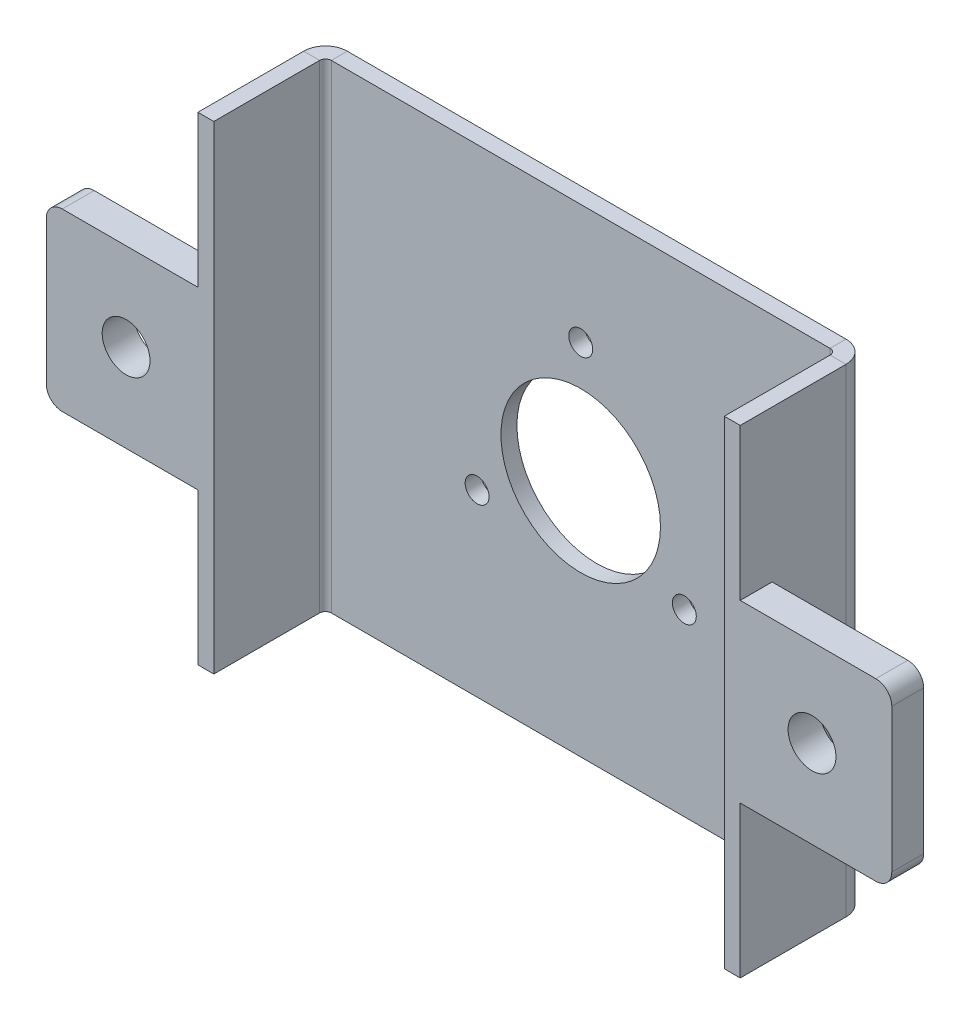
ISO-10303-21;
HEADER;
FILE_DESCRIPTION(('STEP AP214'),'2;1');
FILE_NAME('part.step','',(''),(''),'','','');
FILE_SCHEMA(('AUTOMOTIVE_DESIGN { 1 0 10303 214 1 1 1 1 }'));
ENDSEC;
DATA;
#1=APPLICATION_CONTEXT('core data for automotive mechanical design processes');
#2=APPLICATION_PROTOCOL_DEFINITION('international standard','automotive_design',2000,#1);
#3=PRODUCT_CONTEXT('',#1,'mechanical');
#4=PRODUCT('Part','Part','',(#3));
#5=PRODUCT_RELATED_PRODUCT_CATEGORY('part','',(#4));
#6=PRODUCT_DEFINITION_FORMATION('','',#4);
#7=PRODUCT_DEFINITION_CONTEXT('part definition',#1,'design');
#8=PRODUCT_DEFINITION('design','',#6,#7);
#9=PRODUCT_DEFINITION_SHAPE('','',#8);
#10=(LENGTH_UNIT() NAMED_UNIT(*) SI_UNIT(.MILLI.,.METRE.));
#11=(NAMED_UNIT(*) PLANE_ANGLE_UNIT() SI_UNIT($,.RADIAN.));
#12=(NAMED_UNIT(*) SI_UNIT($,.STERADIAN.) SOLID_ANGLE_UNIT());
#13=UNCERTAINTY_MEASURE_WITH_UNIT(LENGTH_MEASURE(1.E-05),#10,'distance_accuracy_value','');
#14=(GEOMETRIC_REPRESENTATION_CONTEXT(3) GLOBAL_UNCERTAINTY_ASSIGNED_CONTEXT((#13)) GLOBAL_UNIT_ASSIGNED_CONTEXT((#10,
#11,#12)) REPRESENTATION_CONTEXT('',''));
#15=CARTESIAN_POINT('',(0.,0.,0.));
#16=DIRECTION('',(0.,0.,1.));
#17=DIRECTION('',(1.,0.,0.));
#18=AXIS2_PLACEMENT_3D('',#15,#16,#17);
#19=CARTESIAN_POINT('',(0.,0.,0.));
#20=DIRECTION('',(0.,0.,-1.));
#21=DIRECTION('',(-1.,0.,0.));
#22=AXIS2_PLACEMENT_3D('',#19,#20,#21);
#23=PLANE('',#22);
#24=CARTESIAN_POINT('',(12.9903810567666,-7.49999999999988,0.));
#25=DIRECTION('',(0.,0.,1.));
#26=DIRECTION('',(1.,0.,0.));
#27=AXIS2_PLACEMENT_3D('',#24,#25,#26);
#28=CIRCLE('',#27,1.5);
#29=CARTESIAN_POINT('',(14.4903810567666,-7.49999999999988,0.));
#30=VERTEX_POINT('',#29);
#31=EDGE_CURVE('E445',#30,#30,#28,.T.);
#32=ORIENTED_EDGE('',*,*,#31,.F.);
#33=EDGE_LOOP('',(#32));
#34=FACE_BOUND('',#33,.T.);
#35=DIRECTION('',(0.,1.,0.));
#36=VECTOR('',#35,1.);
#37=CARTESIAN_POINT('',(31.2634,30.,0.));
#38=LINE('',#37,#36);
#39=CARTESIAN_POINT('',(31.2634,30.,0.));
#40=VERTEX_POINT('',#39);
#41=CARTESIAN_POINT('',(31.2634,-30.,0.));
#42=VERTEX_POINT('',#41);
#43=EDGE_CURVE('E307',#40,#42,#38,.F.);
#44=ORIENTED_EDGE('',*,*,#43,.F.);
#45=DIRECTION('',(-1.,0.,0.));
#46=VECTOR('',#45,1.);
#47=CARTESIAN_POINT('',(-32.,30.,0.));
#48=LINE('',#47,#46);
#49=CARTESIAN_POINT('',(-31.2634,30.,0.));
#50=VERTEX_POINT('',#49);
#51=EDGE_CURVE('E369',#40,#50,#48,.T.);
#52=ORIENTED_EDGE('',*,*,#51,.T.);
#53=DIRECTION('',(0.,-1.,0.));
#54=VECTOR('',#53,1.);
#55=CARTESIAN_POINT('',(-31.2634,-30.,0.));
#56=LINE('',#55,#54);
#57=CARTESIAN_POINT('',(-31.2634,-30.,0.));
#58=VERTEX_POINT('',#57);
#59=EDGE_CURVE('E362',#58,#50,#56,.F.);
#60=ORIENTED_EDGE('',*,*,#59,.F.);
#61=DIRECTION('',(1.,0.,0.));
#62=VECTOR('',#61,1.);
#63=CARTESIAN_POINT('',(-32.,-30.,0.));
#64=LINE('',#63,#62);
#65=EDGE_CURVE('E376',#58,#42,#64,.T.);
#66=ORIENTED_EDGE('',*,*,#65,.T.);
#67=EDGE_LOOP('',(#44,#52,#60,#66));
#68=FACE_BOUND('',#67,.T.);
#69=CARTESIAN_POINT('',(0.,0.,0.));
#70=DIRECTION('',(0.,0.,1.));
#71=DIRECTION('',(1.,0.,0.));
#72=AXIS2_PLACEMENT_3D('',#69,#70,#71);
#73=CIRCLE('',#72,10.);
#74=CARTESIAN_POINT('',(10.,0.,0.));
#75=VERTEX_POINT('',#74);
#76=EDGE_CURVE('E427',#75,#75,#73,.T.);
#77=ORIENTED_EDGE('',*,*,#76,.F.);
#78=EDGE_LOOP('',(#77));
#79=FACE_BOUND('',#78,.T.);
#80=CARTESIAN_POINT('',(0.,15.,0.));
#81=DIRECTION('',(0.,0.,1.));
#82=DIRECTION('',(1.,0.,0.));
#83=AXIS2_PLACEMENT_3D('',#80,#81,#82);
#84=CIRCLE('',#83,1.5);
#85=CARTESIAN_POINT('',(1.5,15.,0.));
#86=VERTEX_POINT('',#85);
#87=EDGE_CURVE('E436',#86,#86,#84,.T.);
#88=ORIENTED_EDGE('',*,*,#87,.F.);
#89=EDGE_LOOP('',(#88));
#90=FACE_BOUND('',#89,.T.);
#91=CARTESIAN_POINT('',(-12.9903810567665,-7.50000000000006,0.));
#92=DIRECTION('',(0.,0.,1.));
#93=DIRECTION('',(1.,0.,0.));
#94=AXIS2_PLACEMENT_3D('',#91,#92,#93);
#95=CIRCLE('',#94,1.5);
#96=CARTESIAN_POINT('',(-11.4903810567665,-7.50000000000006,0.));
#97=VERTEX_POINT('',#96);
#98=EDGE_CURVE('E442',#97,#97,#95,.T.);
#99=ORIENTED_EDGE('',*,*,#98,.F.);
#100=EDGE_LOOP('',(#99));
#101=FACE_BOUND('',#100,.T.);
#102=ADVANCED_FACE('F35',(#34,#68,#79,#90,#101),#23,.F.);
#103=CARTESIAN_POINT('',(-34.,0.,-1.18005265140202E-13));
#104=DIRECTION('',(1.,0.,0.));
#105=DIRECTION('',(0.,0.,-1.));
#106=AXIS2_PLACEMENT_3D('',#103,#104,#105);
#107=PLANE('',#106);
#108=DIRECTION('',(0.,0.,-1.));
#109=VECTOR('',#108,1.);
#110=CARTESIAN_POINT('',(-34.,11.,9.99999999999999));
#111=LINE('',#110,#109);
#112=CARTESIAN_POINT('',(-34.0000000000001,11.,14.));
#113=VERTEX_POINT('',#112);
#114=CARTESIAN_POINT('',(-34.,11.,10.));
#115=VERTEX_POINT('',#114);
#116=EDGE_CURVE('E209',#113,#115,#111,.T.);
#117=ORIENTED_EDGE('',*,*,#116,.F.);
#118=DIRECTION('',(0.,1.,0.));
#119=VECTOR('',#118,1.);
#120=CARTESIAN_POINT('',(-34.0000000000001,30.,14.));
#121=LINE('',#120,#119);
#122=CARTESIAN_POINT('',(-34.0000000000001,30.,14.));
#123=VERTEX_POINT('',#122);
#124=EDGE_CURVE('E329',#113,#123,#121,.T.);
#125=ORIENTED_EDGE('',*,*,#124,.T.);
#126=DIRECTION('',(0.,0.,-1.));
#127=VECTOR('',#126,1.);
#128=CARTESIAN_POINT('',(-34.,30.,0.));
#129=LINE('',#128,#127);
#130=CARTESIAN_POINT('',(-34.,30.,0.73659999999999));
#131=VERTEX_POINT('',#130);
#132=EDGE_CURVE('E334',#123,#131,#129,.T.);
#133=ORIENTED_EDGE('',*,*,#132,.T.);
#134=DIRECTION('',(0.,1.,0.));
#135=VECTOR('',#134,1.);
#136=CARTESIAN_POINT('',(-34.,0.,0.73659999999999));
#137=LINE('',#136,#135);
#138=CARTESIAN_POINT('',(-34.,-30.,0.73659999999999));
#139=VERTEX_POINT('',#138);
#140=EDGE_CURVE('E322',#139,#131,#137,.T.);
#141=ORIENTED_EDGE('',*,*,#140,.F.);
#142=DIRECTION('',(0.,0.,1.));
#143=VECTOR('',#142,1.);
#144=CARTESIAN_POINT('',(-34.0000000000001,-30.,14.));
#145=LINE('',#144,#143);
#146=CARTESIAN_POINT('',(-34.0000000000001,-30.,14.));
#147=VERTEX_POINT('',#146);
#148=EDGE_CURVE('E327',#139,#147,#145,.T.);
#149=ORIENTED_EDGE('',*,*,#148,.T.);
#150=CARTESIAN_POINT('',(-34.0000000000001,-11.,14.));
#151=VERTEX_POINT('',#150);
#152=EDGE_CURVE('E331',#147,#151,#121,.T.);
#153=ORIENTED_EDGE('',*,*,#152,.T.);
#154=DIRECTION('',(0.,0.,1.));
#155=VECTOR('',#154,1.);
#156=CARTESIAN_POINT('',(-34.,-11.,10.));
#157=LINE('',#156,#155);
#158=CARTESIAN_POINT('',(-34.,-11.,9.99999999999993));
#159=VERTEX_POINT('',#158);
#160=EDGE_CURVE('E250',#159,#151,#157,.T.);
#161=ORIENTED_EDGE('',*,*,#160,.F.);
#162=DIRECTION('',(0.,-1.,0.));
#163=VECTOR('',#162,1.);
#164=CARTESIAN_POINT('',(-34.,11.,9.99999999999999));
#165=LINE('',#164,#163);
#166=EDGE_CURVE('E256',#115,#159,#165,.T.);
#167=ORIENTED_EDGE('',*,*,#166,.F.);
#168=EDGE_LOOP('',(#117,#125,#133,#141,#149,#153,#161,#167));
#169=FACE_BOUND('',#168,.T.);
#170=ADVANCED_FACE('F458',(#169),#107,.F.);
#171=CARTESIAN_POINT('',(0.,0.,-2.));
#172=DIRECTION('',(0.,0.,-1.));
#173=DIRECTION('',(-1.,0.,0.));
#174=AXIS2_PLACEMENT_3D('',#171,#172,#173);
#175=PLANE('',#174);
#176=CARTESIAN_POINT('',(12.9903810567666,-7.49999999999988,-2.));
#177=DIRECTION('',(0.,0.,-1.));
#178=DIRECTION('',(-1.,0.,0.));
#179=AXIS2_PLACEMENT_3D('',#176,#177,#178);
#180=CIRCLE('',#179,1.5);
#181=CARTESIAN_POINT('',(11.4903810567667,-7.49999999999988,-2.));
#182=VERTEX_POINT('',#181);
#183=EDGE_CURVE('E39',#182,#182,#180,.T.);
#184=ORIENTED_EDGE('',*,*,#183,.F.);
#185=EDGE_LOOP('',(#184));
#186=FACE_BOUND('',#185,.T.);
#187=CARTESIAN_POINT('',(-12.9903810567665,-7.50000000000006,-2.));
#188=DIRECTION('',(0.,0.,-1.));
#189=DIRECTION('',(-1.,0.,0.));
#190=AXIS2_PLACEMENT_3D('',#187,#188,#189);
#191=CIRCLE('',#190,1.5);
#192=CARTESIAN_POINT('',(-14.4903810567665,-7.50000000000006,-2.));
#193=VERTEX_POINT('',#192);
#194=EDGE_CURVE('E439',#193,#193,#191,.T.);
#195=ORIENTED_EDGE('',*,*,#194,.F.);
#196=EDGE_LOOP('',(#195));
#197=FACE_BOUND('',#196,.T.);
#198=CARTESIAN_POINT('',(0.,15.,-2.));
#199=DIRECTION('',(0.,0.,-1.));
#200=DIRECTION('',(-1.,0.,0.));
#201=AXIS2_PLACEMENT_3D('',#198,#199,#200);
#202=CIRCLE('',#201,1.5);
#203=CARTESIAN_POINT('',(-1.5,15.,-2.));
#204=VERTEX_POINT('',#203);
#205=EDGE_CURVE('E431',#204,#204,#202,.T.);
#206=ORIENTED_EDGE('',*,*,#205,.F.);
#207=EDGE_LOOP('',(#206));
#208=FACE_BOUND('',#207,.T.);
#209=CARTESIAN_POINT('',(0.,0.,-2.));
#210=DIRECTION('',(0.,0.,-1.));
#211=DIRECTION('',(-1.,0.,0.));
#212=AXIS2_PLACEMENT_3D('',#209,#210,#211);
#213=CIRCLE('',#212,10.);
#214=CARTESIAN_POINT('',(-10.,0.,-2.));
#215=VERTEX_POINT('',#214);
#216=EDGE_CURVE('E428',#215,#215,#213,.F.);
#217=ORIENTED_EDGE('',*,*,#216,.T.);
#218=EDGE_LOOP('',(#217));
#219=FACE_BOUND('',#218,.T.);
#220=DIRECTION('',(-1.,0.,0.));
#221=VECTOR('',#220,1.);
#222=CARTESIAN_POINT('',(-32.,30.,-2.));
#223=LINE('',#222,#221);
#224=CARTESIAN_POINT('',(31.2634,30.,-2.));
#225=VERTEX_POINT('',#224);
#226=CARTESIAN_POINT('',(-31.2634,30.,-2.));
#227=VERTEX_POINT('',#226);
#228=EDGE_CURVE('E372',#225,#227,#223,.T.);
#229=ORIENTED_EDGE('',*,*,#228,.F.);
#230=DIRECTION('',(0.,1.,0.));
#231=VECTOR('',#230,1.);
#232=CARTESIAN_POINT('',(31.2634,30.,-2.));
#233=LINE('',#232,#231);
#234=CARTESIAN_POINT('',(31.2634,-30.,-2.));
#235=VERTEX_POINT('',#234);
#236=EDGE_CURVE('E294',#225,#235,#233,.F.);
#237=ORIENTED_EDGE('',*,*,#236,.T.);
#238=DIRECTION('',(1.,0.,0.));
#239=VECTOR('',#238,1.);
#240=CARTESIAN_POINT('',(-32.,-30.,-2.));
#241=LINE('',#240,#239);
#242=CARTESIAN_POINT('',(-31.2634,-30.,-2.));
#243=VERTEX_POINT('',#242);
#244=EDGE_CURVE('E375',#243,#235,#241,.T.);
#245=ORIENTED_EDGE('',*,*,#244,.F.);
#246=DIRECTION('',(0.,-1.,0.));
#247=VECTOR('',#246,1.);
#248=CARTESIAN_POINT('',(-31.2634,-30.,-2.));
#249=LINE('',#248,#247);
#250=EDGE_CURVE('E349',#243,#227,#249,.F.);
#251=ORIENTED_EDGE('',*,*,#250,.T.);
#252=EDGE_LOOP('',(#229,#237,#245,#251));
#253=FACE_BOUND('',#252,.T.);
#254=ADVANCED_FACE('F454',(#186,#197,#208,#219,#253),#175,.T.);
#255=CARTESIAN_POINT('',(-32.,30.,-2.));
#256=DIRECTION('',(0.,1.,0.));
#257=DIRECTION('',(0.,0.,1.));
#258=AXIS2_PLACEMENT_3D('',#255,#256,#257);
#259=PLANE('',#258);
#260=ORIENTED_EDGE('',*,*,#51,.F.);
#261=DIRECTION('',(0.,0.,-1.));
#262=VECTOR('',#261,1.);
#263=CARTESIAN_POINT('',(31.2634,30.,0.));
#264=LINE('',#263,#262);
#265=EDGE_CURVE('E301',#40,#225,#264,.T.);
#266=ORIENTED_EDGE('',*,*,#265,.T.);
#267=ORIENTED_EDGE('',*,*,#228,.T.);
#268=DIRECTION('',(0.,0.,-1.));
#269=VECTOR('',#268,1.);
#270=CARTESIAN_POINT('',(-31.2634,30.,0.));
#271=LINE('',#270,#269);
#272=EDGE_CURVE('E366',#50,#227,#271,.T.);
#273=ORIENTED_EDGE('',*,*,#272,.F.);
#274=EDGE_LOOP('',(#260,#266,#267,#273));
#275=FACE_BOUND('',#274,.T.);
#276=ADVANCED_FACE('F457',(#275),#259,.T.);
#277=CARTESIAN_POINT('',(-32.,-30.,-2.));
#278=DIRECTION('',(0.,-1.,0.));
#279=DIRECTION('',(0.,0.,-1.));
#280=AXIS2_PLACEMENT_3D('',#277,#278,#279);
#281=PLANE('',#280);
#282=DIRECTION('',(0.,0.,-1.));
#283=VECTOR('',#282,1.);
#284=CARTESIAN_POINT('',(31.2634,-30.,0.));
#285=LINE('',#284,#283);
#286=EDGE_CURVE('E311',#42,#235,#285,.T.);
#287=ORIENTED_EDGE('',*,*,#286,.F.);
#288=ORIENTED_EDGE('',*,*,#65,.F.);
#289=DIRECTION('',(0.,0.,-1.));
#290=VECTOR('',#289,1.);
#291=CARTESIAN_POINT('',(-31.2634,-30.,0.));
#292=LINE('',#291,#290);
#293=EDGE_CURVE('E356',#58,#243,#292,.T.);
#294=ORIENTED_EDGE('',*,*,#293,.T.);
#295=ORIENTED_EDGE('',*,*,#244,.T.);
#296=EDGE_LOOP('',(#287,#288,#294,#295));
#297=FACE_BOUND('',#296,.T.);
#298=ADVANCED_FACE('F486',(#297),#281,.T.);
#299=CARTESIAN_POINT('',(-31.2634,30.,0.7366));
#300=DIRECTION('',(0.,1.,0.));
#301=DIRECTION('',(0.,0.,1.));
#302=AXIS2_PLACEMENT_3D('',#299,#300,#301);
#303=PLANE('',#302);
#304=DIRECTION('',(-1.,0.,0.));
#305=VECTOR('',#304,1.);
#306=CARTESIAN_POINT('',(-32.,30.,0.736599999999997));
#307=LINE('',#306,#305);
#308=CARTESIAN_POINT('',(-32.,30.,0.736599999999997));
#309=VERTEX_POINT('',#308);
#310=EDGE_CURVE('E314',#309,#131,#307,.T.);
#311=ORIENTED_EDGE('',*,*,#310,.F.);
#312=CARTESIAN_POINT('',(-31.2634,30.,0.7366));
#313=DIRECTION('',(0.,-1.,0.));
#314=DIRECTION('',(0.,0.,-1.));
#315=AXIS2_PLACEMENT_3D('',#312,#313,#314);
#316=CIRCLE('',#315,0.736599999999997);
#317=EDGE_CURVE('E359',#50,#309,#316,.F.);
#318=ORIENTED_EDGE('',*,*,#317,.F.);
#319=ORIENTED_EDGE('',*,*,#272,.T.);
#320=CARTESIAN_POINT('',(-31.2634,30.,0.7366));
#321=DIRECTION('',(0.,-1.,0.));
#322=DIRECTION('',(0.,0.,-1.));
#323=AXIS2_PLACEMENT_3D('',#320,#321,#322);
#324=CIRCLE('',#323,2.7366);
#325=EDGE_CURVE('E352',#227,#131,#324,.F.);
#326=ORIENTED_EDGE('',*,*,#325,.T.);
#327=EDGE_LOOP('',(#311,#318,#319,#326));
#328=FACE_BOUND('',#327,.T.);
#329=ADVANCED_FACE('F531',(#328),#303,.T.);
#330=CARTESIAN_POINT('',(-31.2634,-30.,0.7366));
#331=DIRECTION('',(0.,1.,0.));
#332=DIRECTION('',(0.,0.,1.));
#333=AXIS2_PLACEMENT_3D('',#330,#331,#332);
#334=PLANE('',#333);
#335=CARTESIAN_POINT('',(-31.2634,-30.,0.7366));
#336=DIRECTION('',(0.,-1.,0.));
#337=DIRECTION('',(0.,0.,-1.));
#338=AXIS2_PLACEMENT_3D('',#335,#336,#337);
#339=CIRCLE('',#338,0.736599999999997);
#340=CARTESIAN_POINT('',(-32.,-30.,0.736599999999997));
#341=VERTEX_POINT('',#340);
#342=EDGE_CURVE('E348',#341,#58,#339,.T.);
#343=ORIENTED_EDGE('',*,*,#342,.F.);
#344=DIRECTION('',(-1.,0.,0.));
#345=VECTOR('',#344,1.);
#346=CARTESIAN_POINT('',(-32.,-30.,0.736599999999997));
#347=LINE('',#346,#345);
#348=EDGE_CURVE('E319',#341,#139,#347,.T.);
#349=ORIENTED_EDGE('',*,*,#348,.T.);
#350=CARTESIAN_POINT('',(-31.2634,-30.,0.7366));
#351=DIRECTION('',(0.,-1.,0.));
#352=DIRECTION('',(0.,0.,-1.));
#353=AXIS2_PLACEMENT_3D('',#350,#351,#352);
#354=CIRCLE('',#353,2.7366);
#355=EDGE_CURVE('E353',#139,#243,#354,.T.);
#356=ORIENTED_EDGE('',*,*,#355,.T.);
#357=ORIENTED_EDGE('',*,*,#293,.F.);
#358=EDGE_LOOP('',(#343,#349,#356,#357));
#359=FACE_BOUND('',#358,.T.);
#360=ADVANCED_FACE('F594',(#359),#334,.F.);
#361=CARTESIAN_POINT('',(-31.2634,-30.,0.7366));
#362=DIRECTION('',(0.,-1.,0.));
#363=DIRECTION('',(-1.,0.,0.));
#364=AXIS2_PLACEMENT_3D('',#361,#362,#363);
#365=CYLINDRICAL_SURFACE('',#364,2.7366);
#366=ORIENTED_EDGE('',*,*,#250,.F.);
#367=ORIENTED_EDGE('',*,*,#355,.F.);
#368=ORIENTED_EDGE('',*,*,#140,.T.);
#369=ORIENTED_EDGE('',*,*,#325,.F.);
#370=EDGE_LOOP('',(#366,#367,#368,#369));
#371=FACE_BOUND('',#370,.T.);
#372=ADVANCED_FACE('F596',(#371),#365,.T.);
#373=CARTESIAN_POINT('',(-31.2634,-30.,0.7366));
#374=DIRECTION('',(0.,-1.,0.));
#375=DIRECTION('',(-1.,0.,0.));
#376=AXIS2_PLACEMENT_3D('',#373,#374,#375);
#377=CYLINDRICAL_SURFACE('',#376,0.736599999999997);
#378=ORIENTED_EDGE('',*,*,#59,.T.);
#379=ORIENTED_EDGE('',*,*,#317,.T.);
#380=DIRECTION('',(0.,-1.,0.));
#381=VECTOR('',#380,1.);
#382=CARTESIAN_POINT('',(-32.,30.,0.736599999999997));
#383=LINE('',#382,#381);
#384=EDGE_CURVE('E317',#309,#341,#383,.T.);
#385=ORIENTED_EDGE('',*,*,#384,.T.);
#386=ORIENTED_EDGE('',*,*,#342,.T.);
#387=EDGE_LOOP('',(#378,#379,#385,#386));
#388=FACE_BOUND('',#387,.T.);
#389=ADVANCED_FACE('F583',(#388),#377,.F.);
#390=CARTESIAN_POINT('',(-34.0000000000001,-30.,14.));
#391=DIRECTION('',(0.,1.,0.));
#392=DIRECTION('',(0.,0.,1.));
#393=AXIS2_PLACEMENT_3D('',#390,#391,#392);
#394=PLANE('',#393);
#395=ORIENTED_EDGE('',*,*,#348,.F.);
#396=DIRECTION('',(0.,0.,1.));
#397=VECTOR('',#396,1.);
#398=CARTESIAN_POINT('',(-32.0000000000001,-30.,14.));
#399=LINE('',#398,#397);
#400=CARTESIAN_POINT('',(-32.0000000000001,-30.,14.));
#401=VERTEX_POINT('',#400);
#402=EDGE_CURVE('E326',#341,#401,#399,.T.);
#403=ORIENTED_EDGE('',*,*,#402,.T.);
#404=DIRECTION('',(1.,0.,0.));
#405=VECTOR('',#404,1.);
#406=CARTESIAN_POINT('',(-34.0000000000001,-30.,14.));
#407=LINE('',#406,#405);
#408=EDGE_CURVE('E345',#147,#401,#407,.T.);
#409=ORIENTED_EDGE('',*,*,#408,.F.);
#410=ORIENTED_EDGE('',*,*,#148,.F.);
#411=EDGE_LOOP('',(#395,#403,#409,#410));
#412=FACE_BOUND('',#411,.T.);
#413=ADVANCED_FACE('F591',(#412),#394,.F.);
#414=CARTESIAN_POINT('',(-34.,30.,0.));
#415=DIRECTION('',(0.,-1.,0.));
#416=DIRECTION('',(0.,0.,-1.));
#417=AXIS2_PLACEMENT_3D('',#414,#415,#416);
#418=PLANE('',#417);
#419=ORIENTED_EDGE('',*,*,#310,.T.);
#420=ORIENTED_EDGE('',*,*,#132,.F.);
#421=DIRECTION('',(1.,0.,0.));
#422=VECTOR('',#421,1.);
#423=CARTESIAN_POINT('',(-34.0000000000001,30.,14.));
#424=LINE('',#423,#422);
#425=CARTESIAN_POINT('',(-32.0000000000001,30.,14.));
#426=VERTEX_POINT('',#425);
#427=EDGE_CURVE('E337',#123,#426,#424,.T.);
#428=ORIENTED_EDGE('',*,*,#427,.T.);
#429=DIRECTION('',(0.,0.,-1.));
#430=VECTOR('',#429,1.);
#431=CARTESIAN_POINT('',(-32.,30.,0.));
#432=LINE('',#431,#430);
#433=EDGE_CURVE('E330',#426,#309,#432,.T.);
#434=ORIENTED_EDGE('',*,*,#433,.T.);
#435=EDGE_LOOP('',(#419,#420,#428,#434));
#436=FACE_BOUND('',#435,.T.);
#437=ADVANCED_FACE('F578',(#436),#418,.F.);
#438=CARTESIAN_POINT('',(-32.,0.,-1.11022302462516E-13));
#439=DIRECTION('',(1.,0.,0.));
#440=DIRECTION('',(0.,0.,-1.));
#441=AXIS2_PLACEMENT_3D('',#438,#439,#440);
#442=PLANE('',#441);
#443=ORIENTED_EDGE('',*,*,#402,.F.);
#444=ORIENTED_EDGE('',*,*,#384,.F.);
#445=ORIENTED_EDGE('',*,*,#433,.F.);
#446=DIRECTION('',(0.,1.,0.));
#447=VECTOR('',#446,1.);
#448=CARTESIAN_POINT('',(-32.0000000000001,30.,14.));
#449=LINE('',#448,#447);
#450=EDGE_CURVE('E339',#401,#426,#449,.T.);
#451=ORIENTED_EDGE('',*,*,#450,.F.);
#452=EDGE_LOOP('',(#443,#444,#445,#451));
#453=FACE_BOUND('',#452,.T.);
#454=ADVANCED_FACE('F587',(#453),#442,.T.);
#455=CARTESIAN_POINT('',(-34.0000000000001,30.,14.));
#456=DIRECTION('',(0.,0.,-1.));
#457=DIRECTION('',(-1.,0.,0.));
#458=AXIS2_PLACEMENT_3D('',#455,#456,#457);
#459=PLANE('',#458);
#460=CARTESIAN_POINT('',(-43.,0.,14.));
#461=DIRECTION('',(0.,0.,-1.));
#462=DIRECTION('',(-1.,0.,0.));
#463=AXIS2_PLACEMENT_3D('',#460,#461,#462);
#464=CIRCLE('',#463,3.);
#465=CARTESIAN_POINT('',(-46.,0.,14.));
#466=VERTEX_POINT('',#465);
#467=EDGE_CURVE('E228',#466,#466,#464,.T.);
#468=ORIENTED_EDGE('',*,*,#467,.T.);
#469=EDGE_LOOP('',(#468));
#470=FACE_BOUND('',#469,.T.);
#471=DIRECTION('',(0.,1.,0.));
#472=VECTOR('',#471,1.);
#473=CARTESIAN_POINT('',(-53.0000000000001,11.,13.9999999999999));
#474=LINE('',#473,#472);
#475=CARTESIAN_POINT('',(-53.0000000000001,-9.,13.9999999999999));
#476=VERTEX_POINT('',#475);
#477=CARTESIAN_POINT('',(-53.0000000000001,9.,13.9999999999999));
#478=VERTEX_POINT('',#477);
#479=EDGE_CURVE('E246',#476,#478,#474,.T.);
#480=ORIENTED_EDGE('',*,*,#479,.F.);
#481=CARTESIAN_POINT('',(-51.0000000000001,-9.,13.9999999999999));
#482=DIRECTION('',(0.,0.,-1.));
#483=DIRECTION('',(-1.,0.,0.));
#484=AXIS2_PLACEMENT_3D('',#481,#482,#483);
#485=CIRCLE('',#484,2.);
#486=CARTESIAN_POINT('',(-51.0000000000001,-11.,13.9999999999999));
#487=VERTEX_POINT('',#486);
#488=EDGE_CURVE('E391',#476,#487,#485,.F.);
#489=ORIENTED_EDGE('',*,*,#488,.T.);
#490=DIRECTION('',(1.,0.,0.));
#491=VECTOR('',#490,1.);
#492=CARTESIAN_POINT('',(-53.0000000000001,-11.,13.9999999999999));
#493=LINE('',#492,#491);
#494=EDGE_CURVE('E253',#487,#151,#493,.T.);
#495=ORIENTED_EDGE('',*,*,#494,.T.);
#496=ORIENTED_EDGE('',*,*,#152,.F.);
#497=ORIENTED_EDGE('',*,*,#408,.T.);
#498=ORIENTED_EDGE('',*,*,#450,.T.);
#499=ORIENTED_EDGE('',*,*,#427,.F.);
#500=ORIENTED_EDGE('',*,*,#124,.F.);
#501=DIRECTION('',(1.,0.,0.));
#502=VECTOR('',#501,1.);
#503=CARTESIAN_POINT('',(-53.0000000000001,11.,13.9999999999999));
#504=LINE('',#503,#502);
#505=CARTESIAN_POINT('',(-51.0000000000001,11.,13.9999999999999));
#506=VERTEX_POINT('',#505);
#507=EDGE_CURVE('E266',#506,#113,#504,.T.);
#508=ORIENTED_EDGE('',*,*,#507,.F.);
#509=CARTESIAN_POINT('',(-51.0000000000001,9.,13.9999999999999));
#510=DIRECTION('',(0.,0.,-1.));
#511=DIRECTION('',(-1.,0.,0.));
#512=AXIS2_PLACEMENT_3D('',#509,#510,#511);
#513=CIRCLE('',#512,2.);
#514=EDGE_CURVE('E389',#506,#478,#513,.F.);
#515=ORIENTED_EDGE('',*,*,#514,.T.);
#516=EDGE_LOOP('',(#480,#489,#495,#496,#497,#498,#499,#500,#508,#515));
#517=FACE_BOUND('',#516,.T.);
#518=ADVANCED_FACE('F552',(#470,#517),#459,.F.);
#519=CARTESIAN_POINT('',(31.2634,-30.,0.7366));
#520=DIRECTION('',(0.,-1.,0.));
#521=DIRECTION('',(0.,0.,-1.));
#522=AXIS2_PLACEMENT_3D('',#519,#520,#521);
#523=PLANE('',#522);
#524=DIRECTION('',(1.,0.,0.));
#525=VECTOR('',#524,1.);
#526=CARTESIAN_POINT('',(32.,-30.,0.736599999999997));
#527=LINE('',#526,#525);
#528=CARTESIAN_POINT('',(32.,-30.,0.736599999999997));
#529=VERTEX_POINT('',#528);
#530=CARTESIAN_POINT('',(34.,-30.,0.73659999999999));
#531=VERTEX_POINT('',#530);
#532=EDGE_CURVE('E268',#529,#531,#527,.T.);
#533=ORIENTED_EDGE('',*,*,#532,.F.);
#534=CARTESIAN_POINT('',(31.2634,-30.,0.7366));
#535=DIRECTION('',(0.,1.,0.));
#536=DIRECTION('',(0.,0.,1.));
#537=AXIS2_PLACEMENT_3D('',#534,#535,#536);
#538=CIRCLE('',#537,0.736599999999997);
#539=EDGE_CURVE('E304',#42,#529,#538,.F.);
#540=ORIENTED_EDGE('',*,*,#539,.F.);
#541=ORIENTED_EDGE('',*,*,#286,.T.);
#542=CARTESIAN_POINT('',(31.2634,-30.,0.7366));
#543=DIRECTION('',(0.,1.,0.));
#544=DIRECTION('',(0.,0.,1.));
#545=AXIS2_PLACEMENT_3D('',#542,#543,#544);
#546=CIRCLE('',#545,2.7366);
#547=EDGE_CURVE('E297',#235,#531,#546,.F.);
#548=ORIENTED_EDGE('',*,*,#547,.T.);
#549=EDGE_LOOP('',(#533,#540,#541,#548));
#550=FACE_BOUND('',#549,.T.);
#551=ADVANCED_FACE('F488',(#550),#523,.T.);
#552=CARTESIAN_POINT('',(31.2634,30.,0.7366));
#553=DIRECTION('',(0.,-1.,0.));
#554=DIRECTION('',(0.,0.,-1.));
#555=AXIS2_PLACEMENT_3D('',#552,#553,#554);
#556=PLANE('',#555);
#557=CARTESIAN_POINT('',(31.2634,30.,0.7366));
#558=DIRECTION('',(0.,1.,0.));
#559=DIRECTION('',(0.,0.,1.));
#560=AXIS2_PLACEMENT_3D('',#557,#558,#559);
#561=CIRCLE('',#560,0.736599999999997);
#562=CARTESIAN_POINT('',(32.,30.,0.736599999999997));
#563=VERTEX_POINT('',#562);
#564=EDGE_CURVE('E293',#563,#40,#561,.T.);
#565=ORIENTED_EDGE('',*,*,#564,.F.);
#566=DIRECTION('',(1.,0.,0.));
#567=VECTOR('',#566,1.);
#568=CARTESIAN_POINT('',(32.,30.,0.736599999999997));
#569=LINE('',#568,#567);
#570=CARTESIAN_POINT('',(34.,30.,0.73659999999999));
#571=VERTEX_POINT('',#570);
#572=EDGE_CURVE('E271',#563,#571,#569,.T.);
#573=ORIENTED_EDGE('',*,*,#572,.T.);
#574=CARTESIAN_POINT('',(31.2634,30.,0.7366));
#575=DIRECTION('',(0.,1.,0.));
#576=DIRECTION('',(0.,0.,1.));
#577=AXIS2_PLACEMENT_3D('',#574,#575,#576);
#578=CIRCLE('',#577,2.7366);
#579=EDGE_CURVE('E298',#571,#225,#578,.T.);
#580=ORIENTED_EDGE('',*,*,#579,.T.);
#581=ORIENTED_EDGE('',*,*,#265,.F.);
#582=EDGE_LOOP('',(#565,#573,#580,#581));
#583=FACE_BOUND('',#582,.T.);
#584=ADVANCED_FACE('F473',(#583),#556,.F.);
#585=CARTESIAN_POINT('',(31.2634,30.,0.7366));
#586=DIRECTION('',(0.,1.,0.));
#587=DIRECTION('',(1.,0.,0.));
#588=AXIS2_PLACEMENT_3D('',#585,#586,#587);
#589=CYLINDRICAL_SURFACE('',#588,2.7366);
#590=ORIENTED_EDGE('',*,*,#236,.F.);
#591=ORIENTED_EDGE('',*,*,#579,.F.);
#592=DIRECTION('',(0.,-1.,0.));
#593=VECTOR('',#592,1.);
#594=CARTESIAN_POINT('',(34.,0.,0.73659999999999));
#595=LINE('',#594,#593);
#596=EDGE_CURVE('E274',#571,#531,#595,.T.);
#597=ORIENTED_EDGE('',*,*,#596,.T.);
#598=ORIENTED_EDGE('',*,*,#547,.F.);
#599=EDGE_LOOP('',(#590,#591,#597,#598));
#600=FACE_BOUND('',#599,.T.);
#601=ADVANCED_FACE('F675',(#600),#589,.T.);
#602=CARTESIAN_POINT('',(31.2634,30.,0.7366));
#603=DIRECTION('',(0.,1.,0.));
#604=DIRECTION('',(1.,0.,0.));
#605=AXIS2_PLACEMENT_3D('',#602,#603,#604);
#606=CYLINDRICAL_SURFACE('',#605,0.736599999999997);
#607=ORIENTED_EDGE('',*,*,#43,.T.);
#608=ORIENTED_EDGE('',*,*,#539,.T.);
#609=DIRECTION('',(0.,1.,0.));
#610=VECTOR('',#609,1.);
#611=CARTESIAN_POINT('',(32.,-30.,0.736599999999997));
#612=LINE('',#611,#610);
#613=EDGE_CURVE('E269',#529,#563,#612,.T.);
#614=ORIENTED_EDGE('',*,*,#613,.T.);
#615=ORIENTED_EDGE('',*,*,#564,.T.);
#616=EDGE_LOOP('',(#607,#608,#614,#615));
#617=FACE_BOUND('',#616,.T.);
#618=ADVANCED_FACE('F477',(#617),#606,.F.);
#619=CARTESIAN_POINT('',(34.,30.,14.));
#620=DIRECTION('',(0.,-1.,0.));
#621=DIRECTION('',(0.,0.,-1.));
#622=AXIS2_PLACEMENT_3D('',#619,#620,#621);
#623=PLANE('',#622);
#624=ORIENTED_EDGE('',*,*,#572,.F.);
#625=DIRECTION('',(0.,0.,1.));
#626=VECTOR('',#625,1.);
#627=CARTESIAN_POINT('',(32.,30.,14.));
#628=LINE('',#627,#626);
#629=CARTESIAN_POINT('',(32.,30.,14.));
#630=VERTEX_POINT('',#629);
#631=EDGE_CURVE('E278',#563,#630,#628,.T.);
#632=ORIENTED_EDGE('',*,*,#631,.T.);
#633=DIRECTION('',(-1.,0.,0.));
#634=VECTOR('',#633,1.);
#635=CARTESIAN_POINT('',(34.,30.,14.));
#636=LINE('',#635,#634);
#637=CARTESIAN_POINT('',(34.,30.,14.));
#638=VERTEX_POINT('',#637);
#639=EDGE_CURVE('E290',#638,#630,#636,.T.);
#640=ORIENTED_EDGE('',*,*,#639,.F.);
#641=DIRECTION('',(0.,0.,1.));
#642=VECTOR('',#641,1.);
#643=CARTESIAN_POINT('',(34.,30.,14.));
#644=LINE('',#643,#642);
#645=EDGE_CURVE('E221',#571,#638,#644,.T.);
#646=ORIENTED_EDGE('',*,*,#645,.F.);
#647=EDGE_LOOP('',(#624,#632,#640,#646));
#648=FACE_BOUND('',#647,.T.);
#649=ADVANCED_FACE('F501',(#648),#623,.F.);
#650=CARTESIAN_POINT('',(34.,-30.,0.));
#651=DIRECTION('',(0.,1.,0.));
#652=DIRECTION('',(0.,0.,1.));
#653=AXIS2_PLACEMENT_3D('',#650,#651,#652);
#654=PLANE('',#653);
#655=ORIENTED_EDGE('',*,*,#532,.T.);
#656=DIRECTION('',(0.,0.,-1.));
#657=VECTOR('',#656,1.);
#658=CARTESIAN_POINT('',(34.,-30.,0.));
#659=LINE('',#658,#657);
#660=CARTESIAN_POINT('',(34.,-30.,14.));
#661=VERTEX_POINT('',#660);
#662=EDGE_CURVE('E282',#661,#531,#659,.T.);
#663=ORIENTED_EDGE('',*,*,#662,.F.);
#664=DIRECTION('',(-1.,0.,0.));
#665=VECTOR('',#664,1.);
#666=CARTESIAN_POINT('',(34.,-30.,14.));
#667=LINE('',#666,#665);
#668=CARTESIAN_POINT('',(32.,-30.,14.));
#669=VERTEX_POINT('',#668);
#670=EDGE_CURVE('E216',#661,#669,#667,.T.);
#671=ORIENTED_EDGE('',*,*,#670,.T.);
#672=DIRECTION('',(0.,0.,-1.));
#673=VECTOR('',#672,1.);
#674=CARTESIAN_POINT('',(32.,-30.,0.));
#675=LINE('',#674,#673);
#676=EDGE_CURVE('E279',#669,#529,#675,.T.);
#677=ORIENTED_EDGE('',*,*,#676,.T.);
#678=EDGE_LOOP('',(#655,#663,#671,#677));
#679=FACE_BOUND('',#678,.T.);
#680=ADVANCED_FACE('F495',(#679),#654,.F.);
#681=CARTESIAN_POINT('',(34.,0.,-1.18005265140202E-13));
#682=DIRECTION('',(-1.,0.,0.));
#683=DIRECTION('',(0.,0.,1.));
#684=AXIS2_PLACEMENT_3D('',#681,#682,#683);
#685=PLANE('',#684);
#686=DIRECTION('',(0.,-1.,0.));
#687=VECTOR('',#686,1.);
#688=CARTESIAN_POINT('',(34.,11.,9.99999999999999));
#689=LINE('',#688,#687);
#690=CARTESIAN_POINT('',(34.,11.,9.99999999999993));
#691=VERTEX_POINT('',#690);
#692=CARTESIAN_POINT('',(34.,-11.,10.));
#693=VERTEX_POINT('',#692);
#694=EDGE_CURVE('E227',#691,#693,#689,.T.);
#695=ORIENTED_EDGE('',*,*,#694,.T.);
#696=DIRECTION('',(0.,0.,1.));
#697=VECTOR('',#696,1.);
#698=CARTESIAN_POINT('',(34.,-11.,10.));
#699=LINE('',#698,#697);
#700=CARTESIAN_POINT('',(34.0000000000001,-11.,14.));
#701=VERTEX_POINT('',#700);
#702=EDGE_CURVE('E205',#693,#701,#699,.T.);
#703=ORIENTED_EDGE('',*,*,#702,.T.);
#704=DIRECTION('',(0.,-1.,0.));
#705=VECTOR('',#704,1.);
#706=CARTESIAN_POINT('',(34.,-30.,14.));
#707=LINE('',#706,#705);
#708=EDGE_CURVE('E213',#701,#661,#707,.T.);
#709=ORIENTED_EDGE('',*,*,#708,.T.);
#710=ORIENTED_EDGE('',*,*,#662,.T.);
#711=ORIENTED_EDGE('',*,*,#596,.F.);
#712=ORIENTED_EDGE('',*,*,#645,.T.);
#713=CARTESIAN_POINT('',(34.,11.,14.));
#714=VERTEX_POINT('',#713);
#715=EDGE_CURVE('E220',#638,#714,#707,.T.);
#716=ORIENTED_EDGE('',*,*,#715,.T.);
#717=DIRECTION('',(0.,0.,-1.));
#718=VECTOR('',#717,1.);
#719=CARTESIAN_POINT('',(34.,11.,9.99999999999999));
#720=LINE('',#719,#718);
#721=EDGE_CURVE('E230',#714,#691,#720,.T.);
#722=ORIENTED_EDGE('',*,*,#721,.T.);
#723=EDGE_LOOP('',(#695,#703,#709,#710,#711,#712,#716,#722));
#724=FACE_BOUND('',#723,.T.);
#725=ADVANCED_FACE('F224',(#724),#685,.F.);
#726=CARTESIAN_POINT('',(32.,0.,-1.11022302462516E-13));
#727=DIRECTION('',(-1.,0.,0.));
#728=DIRECTION('',(0.,0.,1.));
#729=AXIS2_PLACEMENT_3D('',#726,#727,#728);
#730=PLANE('',#729);
#731=ORIENTED_EDGE('',*,*,#631,.F.);
#732=ORIENTED_EDGE('',*,*,#613,.F.);
#733=ORIENTED_EDGE('',*,*,#676,.F.);
#734=DIRECTION('',(0.,-1.,0.));
#735=VECTOR('',#734,1.);
#736=CARTESIAN_POINT('',(32.,-30.,14.));
#737=LINE('',#736,#735);
#738=EDGE_CURVE('E285',#630,#669,#737,.T.);
#739=ORIENTED_EDGE('',*,*,#738,.F.);
#740=EDGE_LOOP('',(#731,#732,#733,#739));
#741=FACE_BOUND('',#740,.T.);
#742=ADVANCED_FACE('F492',(#741),#730,.T.);
#743=CARTESIAN_POINT('',(34.,-30.,14.));
#744=DIRECTION('',(0.,0.,-1.));
#745=DIRECTION('',(-1.,0.,0.));
#746=AXIS2_PLACEMENT_3D('',#743,#744,#745);
#747=PLANE('',#746);
#748=CARTESIAN_POINT('',(43.,0.,14.));
#749=DIRECTION('',(0.,0.,-1.));
#750=DIRECTION('',(-1.,0.,0.));
#751=AXIS2_PLACEMENT_3D('',#748,#749,#750);
#752=CIRCLE('',#751,3.);
#753=CARTESIAN_POINT('',(40.,0.,14.));
#754=VERTEX_POINT('',#753);
#755=EDGE_CURVE('E421',#754,#754,#752,.T.);
#756=ORIENTED_EDGE('',*,*,#755,.T.);
#757=EDGE_LOOP('',(#756));
#758=FACE_BOUND('',#757,.T.);
#759=DIRECTION('',(-1.,0.,0.));
#760=VECTOR('',#759,1.);
#761=CARTESIAN_POINT('',(53.0000000000001,-11.,13.9999999999999));
#762=LINE('',#761,#760);
#763=CARTESIAN_POINT('',(51.0000000000001,-11.,13.9999999999999));
#764=VERTEX_POINT('',#763);
#765=EDGE_CURVE('E200',#764,#701,#762,.T.);
#766=ORIENTED_EDGE('',*,*,#765,.F.);
#767=CARTESIAN_POINT('',(51.0000000000001,-9.,13.9999999999999));
#768=DIRECTION('',(0.,0.,-1.));
#769=DIRECTION('',(-1.,0.,0.));
#770=AXIS2_PLACEMENT_3D('',#767,#768,#769);
#771=CIRCLE('',#770,2.);
#772=CARTESIAN_POINT('',(53.0000000000001,-9.,13.9999999999999));
#773=VERTEX_POINT('',#772);
#774=EDGE_CURVE('E404',#764,#773,#771,.F.);
#775=ORIENTED_EDGE('',*,*,#774,.T.);
#776=DIRECTION('',(0.,1.,0.));
#777=VECTOR('',#776,1.);
#778=CARTESIAN_POINT('',(53.0000000000001,11.,13.9999999999999));
#779=LINE('',#778,#777);
#780=CARTESIAN_POINT('',(53.0000000000001,9.,13.9999999999999));
#781=VERTEX_POINT('',#780);
#782=EDGE_CURVE('E240',#773,#781,#779,.T.);
#783=ORIENTED_EDGE('',*,*,#782,.T.);
#784=CARTESIAN_POINT('',(51.0000000000001,9.,13.9999999999999));
#785=DIRECTION('',(0.,0.,-1.));
#786=DIRECTION('',(-1.,0.,0.));
#787=AXIS2_PLACEMENT_3D('',#784,#785,#786);
#788=CIRCLE('',#787,2.);
#789=CARTESIAN_POINT('',(51.0000000000001,11.,13.9999999999999));
#790=VERTEX_POINT('',#789);
#791=EDGE_CURVE('E402',#781,#790,#788,.F.);
#792=ORIENTED_EDGE('',*,*,#791,.T.);
#793=DIRECTION('',(-1.,0.,0.));
#794=VECTOR('',#793,1.);
#795=CARTESIAN_POINT('',(53.0000000000001,11.,13.9999999999999));
#796=LINE('',#795,#794);
#797=EDGE_CURVE('E241',#790,#714,#796,.T.);
#798=ORIENTED_EDGE('',*,*,#797,.T.);
#799=ORIENTED_EDGE('',*,*,#715,.F.);
#800=ORIENTED_EDGE('',*,*,#639,.T.);
#801=ORIENTED_EDGE('',*,*,#738,.T.);
#802=ORIENTED_EDGE('',*,*,#670,.F.);
#803=ORIENTED_EDGE('',*,*,#708,.F.);
#804=EDGE_LOOP('',(#766,#775,#783,#792,#798,#799,#800,#801,#802,#803));
#805=FACE_BOUND('',#804,.T.);
#806=ADVANCED_FACE('F214',(#758,#805),#747,.F.);
#807=CARTESIAN_POINT('',(-53.,11.,9.99999999999993));
#808=DIRECTION('',(0.,-1.,0.));
#809=DIRECTION('',(0.,0.,-1.));
#810=AXIS2_PLACEMENT_3D('',#807,#808,#809);
#811=PLANE('',#810);
#812=DIRECTION('',(1.,0.,0.));
#813=VECTOR('',#812,1.);
#814=CARTESIAN_POINT('',(-53.,11.,9.99999999999993));
#815=LINE('',#814,#813);
#816=CARTESIAN_POINT('',(-51.,11.,9.99999999999994));
#817=VERTEX_POINT('',#816);
#818=EDGE_CURVE('E264',#817,#115,#815,.T.);
#819=ORIENTED_EDGE('',*,*,#818,.F.);
#820=DIRECTION('',(0.,0.,-1.));
#821=VECTOR('',#820,1.);
#822=CARTESIAN_POINT('',(-51.0000000000001,11.,13.9999999999999));
#823=LINE('',#822,#821);
#824=EDGE_CURVE('E399',#817,#506,#823,.F.);
#825=ORIENTED_EDGE('',*,*,#824,.T.);
#826=ORIENTED_EDGE('',*,*,#507,.T.);
#827=ORIENTED_EDGE('',*,*,#116,.T.);
#828=EDGE_LOOP('',(#819,#825,#826,#827));
#829=FACE_BOUND('',#828,.T.);
#830=ADVANCED_FACE('F571',(#829),#811,.F.);
#831=CARTESIAN_POINT('',(-53.,11.,9.99999999999993));
#832=DIRECTION('',(0.,0.,1.));
#833=DIRECTION('',(1.,0.,0.));
#834=AXIS2_PLACEMENT_3D('',#831,#832,#833);
#835=PLANE('',#834);
#836=CARTESIAN_POINT('',(-43.,0.,10.0000000000003));
#837=DIRECTION('',(0.,0.,-1.));
#838=DIRECTION('',(0.,1.,0.));
#839=AXIS2_PLACEMENT_3D('',#836,#837,#838);
#840=CIRCLE('',#839,3.);
#841=CARTESIAN_POINT('',(-43.,3.,10.0000000000003));
#842=VERTEX_POINT('',#841);
#843=EDGE_CURVE('E233',#842,#842,#840,.T.);
#844=ORIENTED_EDGE('',*,*,#843,.F.);
#845=EDGE_LOOP('',(#844));
#846=FACE_BOUND('',#845,.T.);
#847=DIRECTION('',(1.,0.,0.));
#848=VECTOR('',#847,1.);
#849=CARTESIAN_POINT('',(-53.,-11.,9.99999999999993));
#850=LINE('',#849,#848);
#851=CARTESIAN_POINT('',(-51.,-11.,9.99999999999994));
#852=VERTEX_POINT('',#851);
#853=EDGE_CURVE('E262',#852,#159,#850,.T.);
#854=ORIENTED_EDGE('',*,*,#853,.F.);
#855=CARTESIAN_POINT('',(-51.,-9.,9.99999999999994));
#856=DIRECTION('',(0.,0.,1.));
#857=DIRECTION('',(1.,0.,0.));
#858=AXIS2_PLACEMENT_3D('',#855,#856,#857);
#859=CIRCLE('',#858,2.);
#860=CARTESIAN_POINT('',(-53.,-9.,9.99999999999993));
#861=VERTEX_POINT('',#860);
#862=EDGE_CURVE('E397',#852,#861,#859,.F.);
#863=ORIENTED_EDGE('',*,*,#862,.T.);
#864=DIRECTION('',(0.,-1.,0.));
#865=VECTOR('',#864,1.);
#866=CARTESIAN_POINT('',(-53.,11.,9.99999999999993));
#867=LINE('',#866,#865);
#868=CARTESIAN_POINT('',(-53.,9.,9.99999999999993));
#869=VERTEX_POINT('',#868);
#870=EDGE_CURVE('E249',#869,#861,#867,.T.);
#871=ORIENTED_EDGE('',*,*,#870,.F.);
#872=CARTESIAN_POINT('',(-51.,9.,9.99999999999994));
#873=DIRECTION('',(0.,0.,1.));
#874=DIRECTION('',(1.,0.,0.));
#875=AXIS2_PLACEMENT_3D('',#872,#873,#874);
#876=CIRCLE('',#875,2.);
#877=EDGE_CURVE('E395',#869,#817,#876,.F.);
#878=ORIENTED_EDGE('',*,*,#877,.T.);
#879=ORIENTED_EDGE('',*,*,#818,.T.);
#880=ORIENTED_EDGE('',*,*,#166,.T.);
#881=EDGE_LOOP('',(#854,#863,#871,#878,#879,#880));
#882=FACE_BOUND('',#881,.T.);
#883=ADVANCED_FACE('F568',(#846,#882),#835,.F.);
#884=CARTESIAN_POINT('',(-53.,-11.,9.99999999999993));
#885=DIRECTION('',(0.,1.,0.));
#886=DIRECTION('',(0.,0.,1.));
#887=AXIS2_PLACEMENT_3D('',#884,#885,#886);
#888=PLANE('',#887);
#889=ORIENTED_EDGE('',*,*,#494,.F.);
#890=DIRECTION('',(0.,0.,1.));
#891=VECTOR('',#890,1.);
#892=CARTESIAN_POINT('',(-51.,-11.,9.99999999999994));
#893=LINE('',#892,#891);
#894=EDGE_CURVE('E393',#487,#852,#893,.F.);
#895=ORIENTED_EDGE('',*,*,#894,.T.);
#896=ORIENTED_EDGE('',*,*,#853,.T.);
#897=ORIENTED_EDGE('',*,*,#160,.T.);
#898=EDGE_LOOP('',(#889,#895,#896,#897));
#899=FACE_BOUND('',#898,.T.);
#900=ADVANCED_FACE('F562',(#899),#888,.F.);
#901=CARTESIAN_POINT('',(-53.,0.,-1.83880688453542E-13));
#902=DIRECTION('',(-1.,0.,0.));
#903=DIRECTION('',(0.,0.,1.));
#904=AXIS2_PLACEMENT_3D('',#901,#902,#903);
#905=PLANE('',#904);
#906=ORIENTED_EDGE('',*,*,#870,.T.);
#907=DIRECTION('',(0.,0.,1.));
#908=VECTOR('',#907,1.);
#909=CARTESIAN_POINT('',(-53.0000000000001,-9.,13.9999999999999));
#910=LINE('',#909,#908);
#911=EDGE_CURVE('E386',#861,#476,#910,.T.);
#912=ORIENTED_EDGE('',*,*,#911,.T.);
#913=ORIENTED_EDGE('',*,*,#479,.T.);
#914=DIRECTION('',(0.,0.,-1.));
#915=VECTOR('',#914,1.);
#916=CARTESIAN_POINT('',(-53.0000000000001,9.,9.99999999999993));
#917=LINE('',#916,#915);
#918=EDGE_CURVE('E379',#478,#869,#917,.T.);
#919=ORIENTED_EDGE('',*,*,#918,.T.);
#920=EDGE_LOOP('',(#906,#912,#913,#919));
#921=FACE_BOUND('',#920,.T.);
#922=ADVANCED_FACE('F538',(#921),#905,.T.);
#923=CARTESIAN_POINT('',(-51.,-9.,-1.76941794549634E-13));
#924=DIRECTION('',(0.,0.,-1.));
#925=DIRECTION('',(-1.,0.,0.));
#926=AXIS2_PLACEMENT_3D('',#923,#924,#925);
#927=CYLINDRICAL_SURFACE('',#926,2.);
#928=ORIENTED_EDGE('',*,*,#862,.F.);
#929=ORIENTED_EDGE('',*,*,#894,.F.);
#930=ORIENTED_EDGE('',*,*,#488,.F.);
#931=ORIENTED_EDGE('',*,*,#911,.F.);
#932=EDGE_LOOP('',(#928,#929,#930,#931));
#933=FACE_BOUND('',#932,.T.);
#934=ADVANCED_FACE('F534',(#933),#927,.T.);
#935=CARTESIAN_POINT('',(-51.,9.,-1.76941794549634E-13));
#936=DIRECTION('',(0.,0.,1.));
#937=DIRECTION('',(1.,0.,0.));
#938=AXIS2_PLACEMENT_3D('',#935,#936,#937);
#939=CYLINDRICAL_SURFACE('',#938,2.);
#940=ORIENTED_EDGE('',*,*,#514,.F.);
#941=ORIENTED_EDGE('',*,*,#824,.F.);
#942=ORIENTED_EDGE('',*,*,#877,.F.);
#943=ORIENTED_EDGE('',*,*,#918,.F.);
#944=EDGE_LOOP('',(#940,#941,#942,#943));
#945=FACE_BOUND('',#944,.T.);
#946=ADVANCED_FACE('F537',(#945),#939,.T.);
#947=CARTESIAN_POINT('',(53.,-11.,9.99999999999993));
#948=DIRECTION('',(0.,-1.,0.));
#949=DIRECTION('',(0.,0.,-1.));
#950=AXIS2_PLACEMENT_3D('',#947,#948,#949);
#951=PLANE('',#950);
#952=DIRECTION('',(-1.,0.,0.));
#953=VECTOR('',#952,1.);
#954=CARTESIAN_POINT('',(53.,-11.,9.99999999999993));
#955=LINE('',#954,#953);
#956=CARTESIAN_POINT('',(51.,-11.,9.99999999999994));
#957=VERTEX_POINT('',#956);
#958=EDGE_CURVE('E210',#957,#693,#955,.T.);
#959=ORIENTED_EDGE('',*,*,#958,.F.);
#960=DIRECTION('',(0.,0.,1.));
#961=VECTOR('',#960,1.);
#962=CARTESIAN_POINT('',(51.,-11.,9.99999999999994));
#963=LINE('',#962,#961);
#964=EDGE_CURVE('E207',#957,#764,#963,.T.);
#965=ORIENTED_EDGE('',*,*,#964,.T.);
#966=ORIENTED_EDGE('',*,*,#765,.T.);
#967=ORIENTED_EDGE('',*,*,#702,.F.);
#968=EDGE_LOOP('',(#959,#965,#966,#967));
#969=FACE_BOUND('',#968,.T.);
#970=ADVANCED_FACE('F203',(#969),#951,.T.);
#971=CARTESIAN_POINT('',(53.,11.,9.99999999999993));
#972=DIRECTION('',(0.,0.,-1.));
#973=DIRECTION('',(-1.,0.,0.));
#974=AXIS2_PLACEMENT_3D('',#971,#972,#973);
#975=PLANE('',#974);
#976=CARTESIAN_POINT('',(43.,0.,9.99999999999997));
#977=DIRECTION('',(0.,0.,-1.));
#978=DIRECTION('',(0.,1.,0.));
#979=AXIS2_PLACEMENT_3D('',#976,#977,#978);
#980=CIRCLE('',#979,3.);
#981=CARTESIAN_POINT('',(43.,3.,9.99999999999997));
#982=VERTEX_POINT('',#981);
#983=EDGE_CURVE('E424',#982,#982,#980,.T.);
#984=ORIENTED_EDGE('',*,*,#983,.F.);
#985=EDGE_LOOP('',(#984));
#986=FACE_BOUND('',#985,.T.);
#987=DIRECTION('',(0.,-1.,0.));
#988=VECTOR('',#987,1.);
#989=CARTESIAN_POINT('',(53.,11.,9.99999999999993));
#990=LINE('',#989,#988);
#991=CARTESIAN_POINT('',(53.,9.,9.99999999999993));
#992=VERTEX_POINT('',#991);
#993=CARTESIAN_POINT('',(53.,-9.,9.99999999999993));
#994=VERTEX_POINT('',#993);
#995=EDGE_CURVE('E236',#992,#994,#990,.T.);
#996=ORIENTED_EDGE('',*,*,#995,.T.);
#997=CARTESIAN_POINT('',(51.,-9.,9.99999999999994));
#998=DIRECTION('',(0.,0.,-1.));
#999=DIRECTION('',(-1.,0.,0.));
#1000=AXIS2_PLACEMENT_3D('',#997,#998,#999);
#1001=CIRCLE('',#1000,2.);
#1002=EDGE_CURVE('E44',#994,#957,#1001,.T.);
#1003=ORIENTED_EDGE('',*,*,#1002,.T.);
#1004=ORIENTED_EDGE('',*,*,#958,.T.);
#1005=ORIENTED_EDGE('',*,*,#694,.F.);
#1006=DIRECTION('',(-1.,0.,0.));
#1007=VECTOR('',#1006,1.);
#1008=CARTESIAN_POINT('',(53.,11.,9.99999999999993));
#1009=LINE('',#1008,#1007);
#1010=CARTESIAN_POINT('',(51.,11.,9.99999999999994));
#1011=VERTEX_POINT('',#1010);
#1012=EDGE_CURVE('E243',#1011,#691,#1009,.T.);
#1013=ORIENTED_EDGE('',*,*,#1012,.F.);
#1014=CARTESIAN_POINT('',(51.,9.,9.99999999999994));
#1015=DIRECTION('',(0.,0.,-1.));
#1016=DIRECTION('',(-1.,0.,0.));
#1017=AXIS2_PLACEMENT_3D('',#1014,#1015,#1016);
#1018=CIRCLE('',#1017,2.);
#1019=EDGE_CURVE('E51',#1011,#992,#1018,.T.);
#1020=ORIENTED_EDGE('',*,*,#1019,.T.);
#1021=EDGE_LOOP('',(#996,#1003,#1004,#1005,#1013,#1020));
#1022=FACE_BOUND('',#1021,.T.);
#1023=ADVANCED_FACE('F412',(#986,#1022),#975,.T.);
#1024=CARTESIAN_POINT('',(53.,11.,9.99999999999993));
#1025=DIRECTION('',(0.,1.,0.));
#1026=DIRECTION('',(0.,0.,1.));
#1027=AXIS2_PLACEMENT_3D('',#1024,#1025,#1026);
#1028=PLANE('',#1027);
#1029=ORIENTED_EDGE('',*,*,#797,.F.);
#1030=DIRECTION('',(0.,0.,-1.));
#1031=VECTOR('',#1030,1.);
#1032=CARTESIAN_POINT('',(51.,11.,9.99999999999994));
#1033=LINE('',#1032,#1031);
#1034=EDGE_CURVE('E11',#790,#1011,#1033,.T.);
#1035=ORIENTED_EDGE('',*,*,#1034,.T.);
#1036=ORIENTED_EDGE('',*,*,#1012,.T.);
#1037=ORIENTED_EDGE('',*,*,#721,.F.);
#1038=EDGE_LOOP('',(#1029,#1035,#1036,#1037));
#1039=FACE_BOUND('',#1038,.T.);
#1040=ADVANCED_FACE('F506',(#1039),#1028,.T.);
#1041=CARTESIAN_POINT('',(53.,0.,-1.83880688453542E-13));
#1042=DIRECTION('',(1.,0.,0.));
#1043=DIRECTION('',(0.,0.,1.));
#1044=AXIS2_PLACEMENT_3D('',#1041,#1042,#1043);
#1045=PLANE('',#1044);
#1046=ORIENTED_EDGE('',*,*,#782,.F.);
#1047=DIRECTION('',(0.,0.,1.));
#1048=VECTOR('',#1047,1.);
#1049=CARTESIAN_POINT('',(53.,-9.,-1.83880688453542E-13));
#1050=LINE('',#1049,#1048);
#1051=EDGE_CURVE('E58',#773,#994,#1050,.F.);
#1052=ORIENTED_EDGE('',*,*,#1051,.T.);
#1053=ORIENTED_EDGE('',*,*,#995,.F.);
#1054=DIRECTION('',(0.,0.,-1.));
#1055=VECTOR('',#1054,1.);
#1056=CARTESIAN_POINT('',(53.,9.,-1.83880688453542E-13));
#1057=LINE('',#1056,#1055);
#1058=EDGE_CURVE('E406',#992,#781,#1057,.F.);
#1059=ORIENTED_EDGE('',*,*,#1058,.T.);
#1060=EDGE_LOOP('',(#1046,#1052,#1053,#1059));
#1061=FACE_BOUND('',#1060,.T.);
#1062=ADVANCED_FACE('F417',(#1061),#1045,.T.);
#1063=CARTESIAN_POINT('',(51.,-9.,9.99999999999994));
#1064=DIRECTION('',(0.,0.,1.));
#1065=DIRECTION('',(1.,0.,0.));
#1066=AXIS2_PLACEMENT_3D('',#1063,#1064,#1065);
#1067=CYLINDRICAL_SURFACE('',#1066,2.);
#1068=ORIENTED_EDGE('',*,*,#1002,.F.);
#1069=ORIENTED_EDGE('',*,*,#1051,.F.);
#1070=ORIENTED_EDGE('',*,*,#774,.F.);
#1071=ORIENTED_EDGE('',*,*,#964,.F.);
#1072=EDGE_LOOP('',(#1068,#1069,#1070,#1071));
#1073=FACE_BOUND('',#1072,.T.);
#1074=ADVANCED_FACE('F414',(#1073),#1067,.T.);
#1075=CARTESIAN_POINT('',(51.,9.,9.99999999999994));
#1076=DIRECTION('',(0.,0.,-1.));
#1077=DIRECTION('',(-1.,0.,0.));
#1078=AXIS2_PLACEMENT_3D('',#1075,#1076,#1077);
#1079=CYLINDRICAL_SURFACE('',#1078,2.);
#1080=ORIENTED_EDGE('',*,*,#791,.F.);
#1081=ORIENTED_EDGE('',*,*,#1058,.F.);
#1082=ORIENTED_EDGE('',*,*,#1019,.F.);
#1083=ORIENTED_EDGE('',*,*,#1034,.F.);
#1084=EDGE_LOOP('',(#1080,#1081,#1082,#1083));
#1085=FACE_BOUND('',#1084,.T.);
#1086=ADVANCED_FACE('F37',(#1085),#1079,.T.);
#1087=CARTESIAN_POINT('',(-43.,0.,10.0000000000003));
#1088=DIRECTION('',(0.,0.,-1.));
#1089=DIRECTION('',(0.,1.,0.));
#1090=AXIS2_PLACEMENT_3D('',#1087,#1088,#1089);
#1091=CYLINDRICAL_SURFACE('',#1090,3.);
#1092=ORIENTED_EDGE('',*,*,#843,.T.);
#1093=EDGE_LOOP('',(#1092));
#1094=FACE_BOUND('',#1093,.T.);
#1095=ORIENTED_EDGE('',*,*,#467,.F.);
#1096=EDGE_LOOP('',(#1095));
#1097=FACE_BOUND('',#1096,.T.);
#1098=ADVANCED_FACE('F509',(#1094,#1097),#1091,.F.);
#1099=CARTESIAN_POINT('',(43.,0.,9.99999999999997));
#1100=DIRECTION('',(0.,0.,-1.));
#1101=DIRECTION('',(0.,1.,0.));
#1102=AXIS2_PLACEMENT_3D('',#1099,#1100,#1101);
#1103=CYLINDRICAL_SURFACE('',#1102,3.);
#1104=ORIENTED_EDGE('',*,*,#983,.T.);
#1105=EDGE_LOOP('',(#1104));
#1106=FACE_BOUND('',#1105,.T.);
#1107=ORIENTED_EDGE('',*,*,#755,.F.);
#1108=EDGE_LOOP('',(#1107));
#1109=FACE_BOUND('',#1108,.T.);
#1110=ADVANCED_FACE('F515',(#1106,#1109),#1103,.F.);
#1111=CARTESIAN_POINT('',(0.,0.,-2.001));
#1112=DIRECTION('',(0.,0.,1.));
#1113=DIRECTION('',(1.,0.,0.));
#1114=AXIS2_PLACEMENT_3D('',#1111,#1112,#1113);
#1115=CYLINDRICAL_SURFACE('',#1114,10.);
#1116=ORIENTED_EDGE('',*,*,#216,.F.);
#1117=EDGE_LOOP('',(#1116));
#1118=FACE_BOUND('',#1117,.T.);
#1119=ORIENTED_EDGE('',*,*,#76,.T.);
#1120=EDGE_LOOP('',(#1119));
#1121=FACE_BOUND('',#1120,.T.);
#1122=ADVANCED_FACE('F847',(#1118,#1121),#1115,.F.);
#1123=CARTESIAN_POINT('',(0.,15.,0.));
#1124=DIRECTION('',(0.,0.,1.));
#1125=DIRECTION('',(1.,0.,0.));
#1126=AXIS2_PLACEMENT_3D('',#1123,#1124,#1125);
#1127=CYLINDRICAL_SURFACE('',#1126,1.5);
#1128=ORIENTED_EDGE('',*,*,#205,.T.);
#1129=EDGE_LOOP('',(#1128));
#1130=FACE_BOUND('',#1129,.T.);
#1131=ORIENTED_EDGE('',*,*,#87,.T.);
#1132=EDGE_LOOP('',(#1131));
#1133=FACE_BOUND('',#1132,.T.);
#1134=ADVANCED_FACE('F856',(#1130,#1133),#1127,.F.);
#1135=CARTESIAN_POINT('',(-12.9903810567665,-7.50000000000006,0.));
#1136=DIRECTION('',(0.,0.,1.));
#1137=DIRECTION('',(1.,0.,0.));
#1138=AXIS2_PLACEMENT_3D('',#1135,#1136,#1137);
#1139=CYLINDRICAL_SURFACE('',#1138,1.5);
#1140=ORIENTED_EDGE('',*,*,#194,.T.);
#1141=EDGE_LOOP('',(#1140));
#1142=FACE_BOUND('',#1141,.T.);
#1143=ORIENTED_EDGE('',*,*,#98,.T.);
#1144=EDGE_LOOP('',(#1143));
#1145=FACE_BOUND('',#1144,.T.);
#1146=ADVANCED_FACE('F865',(#1142,#1145),#1139,.F.);
#1147=CARTESIAN_POINT('',(12.9903810567666,-7.49999999999988,0.));
#1148=DIRECTION('',(0.,0.,1.));
#1149=DIRECTION('',(1.,0.,0.));
#1150=AXIS2_PLACEMENT_3D('',#1147,#1148,#1149);
#1151=CYLINDRICAL_SURFACE('',#1150,1.5);
#1152=ORIENTED_EDGE('',*,*,#183,.T.);
#1153=EDGE_LOOP('',(#1152));
#1154=FACE_BOUND('',#1153,.T.);
#1155=ORIENTED_EDGE('',*,*,#31,.T.);
#1156=EDGE_LOOP('',(#1155));
#1157=FACE_BOUND('',#1156,.T.);
#1158=ADVANCED_FACE('F452',(#1154,#1157),#1151,.F.);
#1159=CLOSED_SHELL('',(#102,#170,#254,#276,#298,#329,#360,#372,#389,#413,#437,#454,#518,#551,
#584,#601,#618,#649,#680,#725,#742,#806,#830,#883,#900,#922,#934,#946,#970,#1023,#1040,#1062,
#1074,#1086,#1098,#1110,#1122,#1134,#1146,#1158));
#1160=MANIFOLD_SOLID_BREP('B2',#1159);
#1161=ADVANCED_BREP_SHAPE_REPRESENTATION('',(#18,#1160),#14);
#1162=SHAPE_DEFINITION_REPRESENTATION(#9,#1161);
ENDSEC;
END-ISO-10303-21;
